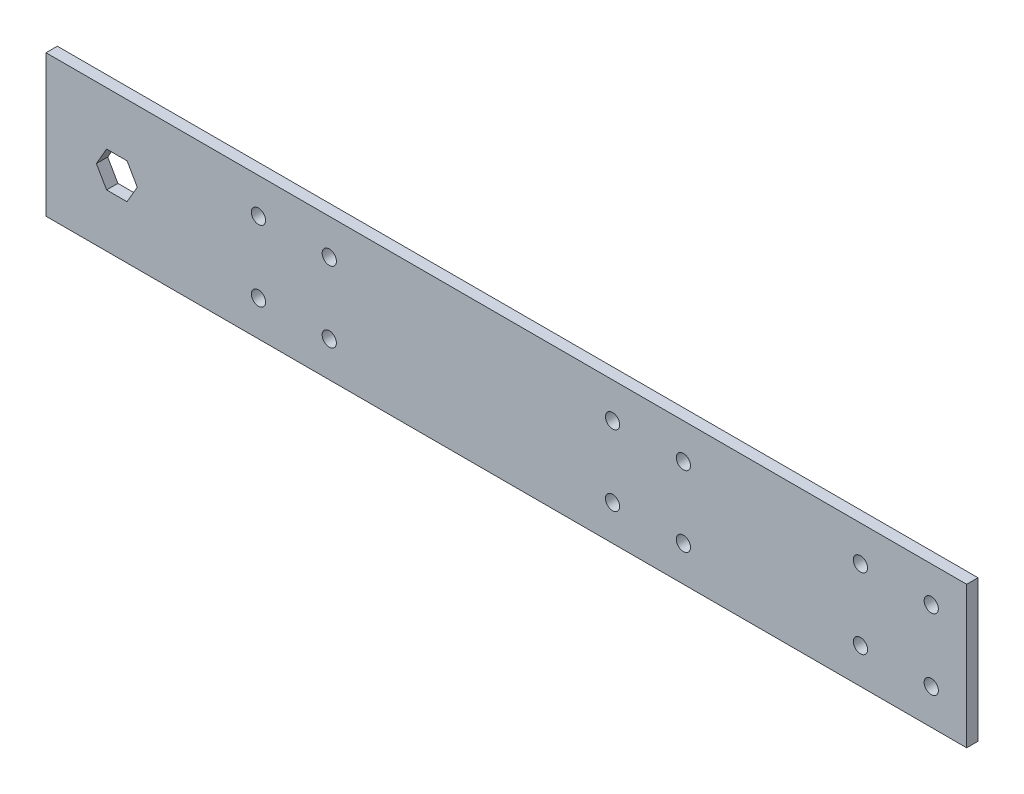
ISO-10303-21;
HEADER;
FILE_DESCRIPTION(('STEP AP214'),'2;1');
FILE_NAME('part.step','',(''),(''),'','','');
FILE_SCHEMA(('AUTOMOTIVE_DESIGN { 1 0 10303 214 1 1 1 1 }'));
ENDSEC;
DATA;
#1=APPLICATION_CONTEXT('core data for automotive mechanical design processes');
#2=APPLICATION_PROTOCOL_DEFINITION('international standard','automotive_design',2000,#1);
#3=PRODUCT_CONTEXT('',#1,'mechanical');
#4=PRODUCT('Part','Part','',(#3));
#5=PRODUCT_RELATED_PRODUCT_CATEGORY('part','',(#4));
#6=PRODUCT_DEFINITION_FORMATION('','',#4);
#7=PRODUCT_DEFINITION_CONTEXT('part definition',#1,'design');
#8=PRODUCT_DEFINITION('design','',#6,#7);
#9=PRODUCT_DEFINITION_SHAPE('','',#8);
#10=(LENGTH_UNIT() NAMED_UNIT(*) SI_UNIT(.MILLI.,.METRE.));
#11=(NAMED_UNIT(*) PLANE_ANGLE_UNIT() SI_UNIT($,.RADIAN.));
#12=(NAMED_UNIT(*) SI_UNIT($,.STERADIAN.) SOLID_ANGLE_UNIT());
#13=UNCERTAINTY_MEASURE_WITH_UNIT(LENGTH_MEASURE(1.E-05),#10,'distance_accuracy_value','');
#14=(GEOMETRIC_REPRESENTATION_CONTEXT(3) GLOBAL_UNCERTAINTY_ASSIGNED_CONTEXT((#13)) GLOBAL_UNIT_ASSIGNED_CONTEXT((#10,
#11,#12)) REPRESENTATION_CONTEXT('',''));
#15=CARTESIAN_POINT('',(0.,0.,0.));
#16=DIRECTION('',(0.,0.,1.));
#17=DIRECTION('',(1.,0.,0.));
#18=AXIS2_PLACEMENT_3D('',#15,#16,#17);
#19=CARTESIAN_POINT('',(0.,0.,4.064));
#20=DIRECTION('',(1.,0.,0.));
#21=DIRECTION('',(0.,0.,-1.));
#22=AXIS2_PLACEMENT_3D('',#19,#20,#21);
#23=PLANE('',#22);
#24=DIRECTION('',(0.,-1.,0.));
#25=VECTOR('',#24,1.);
#26=CARTESIAN_POINT('',(0.,0.,0.));
#27=LINE('',#26,#25);
#28=CARTESIAN_POINT('',(0.,50.8,0.));
#29=VERTEX_POINT('',#28);
#30=CARTESIAN_POINT('',(0.,0.,0.));
#31=VERTEX_POINT('',#30);
#32=EDGE_CURVE('E211',#29,#31,#27,.T.);
#33=ORIENTED_EDGE('',*,*,#32,.T.);
#34=DIRECTION('',(0.,0.,-1.));
#35=VECTOR('',#34,1.);
#36=CARTESIAN_POINT('',(0.,0.,4.064));
#37=LINE('',#36,#35);
#38=CARTESIAN_POINT('',(0.,0.,4.064));
#39=VERTEX_POINT('',#38);
#40=EDGE_CURVE('E11',#39,#31,#37,.T.);
#41=ORIENTED_EDGE('',*,*,#40,.F.);
#42=DIRECTION('',(0.,-1.,0.));
#43=VECTOR('',#42,1.);
#44=CARTESIAN_POINT('',(0.,0.,4.064));
#45=LINE('',#44,#43);
#46=CARTESIAN_POINT('',(0.,50.8,4.064));
#47=VERTEX_POINT('',#46);
#48=EDGE_CURVE('E212',#47,#39,#45,.T.);
#49=ORIENTED_EDGE('',*,*,#48,.F.);
#50=DIRECTION('',(0.,0.,-1.));
#51=VECTOR('',#50,1.);
#52=CARTESIAN_POINT('',(0.,50.8,4.064));
#53=LINE('',#52,#51);
#54=EDGE_CURVE('E222',#47,#29,#53,.T.);
#55=ORIENTED_EDGE('',*,*,#54,.T.);
#56=EDGE_LOOP('',(#33,#41,#49,#55));
#57=FACE_BOUND('',#56,.T.);
#58=ADVANCED_FACE('F32',(#57),#23,.F.);
#59=CARTESIAN_POINT('',(0.,0.,4.064));
#60=DIRECTION('',(0.,1.,0.));
#61=DIRECTION('',(0.,0.,1.));
#62=AXIS2_PLACEMENT_3D('',#59,#60,#61);
#63=PLANE('',#62);
#64=DIRECTION('',(1.,0.,0.));
#65=VECTOR('',#64,1.);
#66=CARTESIAN_POINT('',(0.,0.,0.));
#67=LINE('',#66,#65);
#68=CARTESIAN_POINT('',(330.2,0.,0.));
#69=VERTEX_POINT('',#68);
#70=EDGE_CURVE('E225',#31,#69,#67,.T.);
#71=ORIENTED_EDGE('',*,*,#70,.T.);
#72=DIRECTION('',(0.,0.,-1.));
#73=VECTOR('',#72,1.);
#74=CARTESIAN_POINT('',(330.2,0.,4.064));
#75=LINE('',#74,#73);
#76=CARTESIAN_POINT('',(330.2,0.,4.064));
#77=VERTEX_POINT('',#76);
#78=EDGE_CURVE('E39',#77,#69,#75,.T.);
#79=ORIENTED_EDGE('',*,*,#78,.F.);
#80=DIRECTION('',(1.,0.,0.));
#81=VECTOR('',#80,1.);
#82=CARTESIAN_POINT('',(0.,0.,4.064));
#83=LINE('',#82,#81);
#84=EDGE_CURVE('E215',#39,#77,#83,.T.);
#85=ORIENTED_EDGE('',*,*,#84,.F.);
#86=ORIENTED_EDGE('',*,*,#40,.T.);
#87=EDGE_LOOP('',(#71,#79,#85,#86));
#88=FACE_BOUND('',#87,.T.);
#89=ADVANCED_FACE('F254',(#88),#63,.F.);
#90=CARTESIAN_POINT('',(330.2,0.,4.064));
#91=DIRECTION('',(-1.,0.,0.));
#92=DIRECTION('',(0.,0.,1.));
#93=AXIS2_PLACEMENT_3D('',#90,#91,#92);
#94=PLANE('',#93);
#95=DIRECTION('',(0.,1.,0.));
#96=VECTOR('',#95,1.);
#97=CARTESIAN_POINT('',(330.2,0.,0.));
#98=LINE('',#97,#96);
#99=CARTESIAN_POINT('',(330.2,50.8,0.));
#100=VERTEX_POINT('',#99);
#101=EDGE_CURVE('E227',#69,#100,#98,.T.);
#102=ORIENTED_EDGE('',*,*,#101,.T.);
#103=DIRECTION('',(0.,0.,-1.));
#104=VECTOR('',#103,1.);
#105=CARTESIAN_POINT('',(330.2,50.8,4.064));
#106=LINE('',#105,#104);
#107=CARTESIAN_POINT('',(330.2,50.8,4.064));
#108=VERTEX_POINT('',#107);
#109=EDGE_CURVE('E232',#108,#100,#106,.T.);
#110=ORIENTED_EDGE('',*,*,#109,.F.);
#111=DIRECTION('',(0.,1.,0.));
#112=VECTOR('',#111,1.);
#113=CARTESIAN_POINT('',(330.2,0.,4.064));
#114=LINE('',#113,#112);
#115=EDGE_CURVE('E218',#77,#108,#114,.T.);
#116=ORIENTED_EDGE('',*,*,#115,.F.);
#117=ORIENTED_EDGE('',*,*,#78,.T.);
#118=EDGE_LOOP('',(#102,#110,#116,#117));
#119=FACE_BOUND('',#118,.T.);
#120=ADVANCED_FACE('F239',(#119),#94,.F.);
#121=CARTESIAN_POINT('',(0.,50.8,4.064));
#122=DIRECTION('',(0.,-1.,0.));
#123=DIRECTION('',(0.,0.,-1.));
#124=AXIS2_PLACEMENT_3D('',#121,#122,#123);
#125=PLANE('',#124);
#126=DIRECTION('',(-1.,0.,0.));
#127=VECTOR('',#126,1.);
#128=CARTESIAN_POINT('',(0.,50.8,0.));
#129=LINE('',#128,#127);
#130=EDGE_CURVE('E216',#100,#29,#129,.T.);
#131=ORIENTED_EDGE('',*,*,#130,.T.);
#132=ORIENTED_EDGE('',*,*,#54,.F.);
#133=DIRECTION('',(-1.,0.,0.));
#134=VECTOR('',#133,1.);
#135=CARTESIAN_POINT('',(0.,50.8,4.064));
#136=LINE('',#135,#134);
#137=EDGE_CURVE('E220',#108,#47,#136,.T.);
#138=ORIENTED_EDGE('',*,*,#137,.F.);
#139=ORIENTED_EDGE('',*,*,#109,.T.);
#140=EDGE_LOOP('',(#131,#132,#138,#139));
#141=FACE_BOUND('',#140,.T.);
#142=ADVANCED_FACE('F247',(#141),#125,.F.);
#143=CARTESIAN_POINT('',(0.,0.,4.064));
#144=DIRECTION('',(0.,0.,-1.));
#145=DIRECTION('',(-1.,0.,0.));
#146=AXIS2_PLACEMENT_3D('',#143,#144,#145);
#147=PLANE('',#146);
#148=CARTESIAN_POINT('',(317.5,38.1,4.064));
#149=DIRECTION('',(0.,0.,1.));
#150=DIRECTION('',(1.,0.,0.));
#151=AXIS2_PLACEMENT_3D('',#148,#149,#150);
#152=CIRCLE('',#151,2.55269999999996);
#153=CARTESIAN_POINT('',(320.0527,38.1,4.064));
#154=VERTEX_POINT('',#153);
#155=EDGE_CURVE('E344',#154,#154,#152,.T.);
#156=ORIENTED_EDGE('',*,*,#155,.F.);
#157=EDGE_LOOP('',(#156));
#158=FACE_BOUND('',#157,.T.);
#159=CARTESIAN_POINT('',(292.1,12.7,4.064));
#160=DIRECTION('',(0.,0.,1.));
#161=DIRECTION('',(1.,0.,0.));
#162=AXIS2_PLACEMENT_3D('',#159,#160,#161);
#163=CIRCLE('',#162,2.55269999999996);
#164=CARTESIAN_POINT('',(294.6527,12.7,4.064));
#165=VERTEX_POINT('',#164);
#166=EDGE_CURVE('E346',#165,#165,#163,.T.);
#167=ORIENTED_EDGE('',*,*,#166,.F.);
#168=EDGE_LOOP('',(#167));
#169=FACE_BOUND('',#168,.T.);
#170=CARTESIAN_POINT('',(317.5,12.7,4.064));
#171=DIRECTION('',(0.,0.,1.));
#172=DIRECTION('',(1.,0.,0.));
#173=AXIS2_PLACEMENT_3D('',#170,#171,#172);
#174=CIRCLE('',#173,2.55269999999996);
#175=CARTESIAN_POINT('',(320.0527,12.7,4.064));
#176=VERTEX_POINT('',#175);
#177=EDGE_CURVE('E354',#176,#176,#174,.T.);
#178=ORIENTED_EDGE('',*,*,#177,.F.);
#179=EDGE_LOOP('',(#178));
#180=FACE_BOUND('',#179,.T.);
#181=CARTESIAN_POINT('',(292.1,38.1,4.064));
#182=DIRECTION('',(0.,0.,1.));
#183=DIRECTION('',(1.,0.,0.));
#184=AXIS2_PLACEMENT_3D('',#181,#182,#183);
#185=CIRCLE('',#184,2.55269999999996);
#186=CARTESIAN_POINT('',(294.6527,38.1,4.064));
#187=VERTEX_POINT('',#186);
#188=EDGE_CURVE('E359',#187,#187,#185,.T.);
#189=ORIENTED_EDGE('',*,*,#188,.F.);
#190=EDGE_LOOP('',(#189));
#191=FACE_BOUND('',#190,.T.);
#192=DIRECTION('',(-0.499999999999999,-0.866025403784439,0.));
#193=VECTOR('',#192,1.);
#194=CARTESIAN_POINT('',(21.7338257906459,31.75,4.064));
#195=LINE('',#194,#193);
#196=CARTESIAN_POINT('',(21.7338257906459,31.75,4.064));
#197=VERTEX_POINT('',#196);
#198=CARTESIAN_POINT('',(18.0676515812917,25.4,4.064));
#199=VERTEX_POINT('',#198);
#200=EDGE_CURVE('E144',#197,#199,#195,.T.);
#201=ORIENTED_EDGE('',*,*,#200,.F.);
#202=DIRECTION('',(-1.,0.,0.));
#203=VECTOR('',#202,1.);
#204=CARTESIAN_POINT('',(29.0661742093541,31.75,4.064));
#205=LINE('',#204,#203);
#206=CARTESIAN_POINT('',(29.0661742093541,31.75,4.064));
#207=VERTEX_POINT('',#206);
#208=EDGE_CURVE('E46',#207,#197,#205,.T.);
#209=ORIENTED_EDGE('',*,*,#208,.F.);
#210=DIRECTION('',(-0.500000000000001,0.866025403784438,0.));
#211=VECTOR('',#210,1.);
#212=CARTESIAN_POINT('',(32.7323484187082,25.4,4.064));
#213=LINE('',#212,#211);
#214=CARTESIAN_POINT('',(32.7323484187082,25.4,4.064));
#215=VERTEX_POINT('',#214);
#216=EDGE_CURVE('E127',#215,#207,#213,.T.);
#217=ORIENTED_EDGE('',*,*,#216,.F.);
#218=DIRECTION('',(0.5,0.866025403784439,0.));
#219=VECTOR('',#218,1.);
#220=CARTESIAN_POINT('',(29.0661742093541,19.05,4.064));
#221=LINE('',#220,#219);
#222=CARTESIAN_POINT('',(29.0661742093541,19.05,4.064));
#223=VERTEX_POINT('',#222);
#224=EDGE_CURVE('E130',#223,#215,#221,.T.);
#225=ORIENTED_EDGE('',*,*,#224,.F.);
#226=DIRECTION('',(1.,0.,0.));
#227=VECTOR('',#226,1.);
#228=CARTESIAN_POINT('',(21.7338257906459,19.05,4.064));
#229=LINE('',#228,#227);
#230=CARTESIAN_POINT('',(21.7338257906459,19.05,4.064));
#231=VERTEX_POINT('',#230);
#232=EDGE_CURVE('E149',#231,#223,#229,.T.);
#233=ORIENTED_EDGE('',*,*,#232,.F.);
#234=DIRECTION('',(0.5,-0.866025403784438,0.));
#235=VECTOR('',#234,1.);
#236=CARTESIAN_POINT('',(18.0676515812917,25.4,4.064));
#237=LINE('',#236,#235);
#238=EDGE_CURVE('E146',#199,#231,#237,.T.);
#239=ORIENTED_EDGE('',*,*,#238,.F.);
#240=EDGE_LOOP('',(#201,#209,#217,#225,#233,#239));
#241=FACE_BOUND('',#240,.T.);
#242=CARTESIAN_POINT('',(203.2,12.7,4.064));
#243=DIRECTION('',(0.,0.,1.));
#244=DIRECTION('',(1.,0.,0.));
#245=AXIS2_PLACEMENT_3D('',#242,#243,#244);
#246=CIRCLE('',#245,2.55269999999999);
#247=CARTESIAN_POINT('',(205.7527,12.7,4.064));
#248=VERTEX_POINT('',#247);
#249=EDGE_CURVE('E156',#248,#248,#246,.T.);
#250=ORIENTED_EDGE('',*,*,#249,.F.);
#251=EDGE_LOOP('',(#250));
#252=FACE_BOUND('',#251,.T.);
#253=CARTESIAN_POINT('',(228.6,38.1,4.064));
#254=DIRECTION('',(0.,0.,1.));
#255=DIRECTION('',(1.,0.,0.));
#256=AXIS2_PLACEMENT_3D('',#253,#254,#255);
#257=CIRCLE('',#256,2.55269999999999);
#258=CARTESIAN_POINT('',(231.1527,38.1,4.064));
#259=VERTEX_POINT('',#258);
#260=EDGE_CURVE('E169',#259,#259,#257,.T.);
#261=ORIENTED_EDGE('',*,*,#260,.F.);
#262=EDGE_LOOP('',(#261));
#263=FACE_BOUND('',#262,.T.);
#264=CARTESIAN_POINT('',(203.2,38.1,4.064));
#265=DIRECTION('',(0.,0.,1.));
#266=DIRECTION('',(1.,0.,0.));
#267=AXIS2_PLACEMENT_3D('',#264,#265,#266);
#268=CIRCLE('',#267,2.55269999999999);
#269=CARTESIAN_POINT('',(205.7527,38.1,4.064));
#270=VERTEX_POINT('',#269);
#271=EDGE_CURVE('E175',#270,#270,#268,.T.);
#272=ORIENTED_EDGE('',*,*,#271,.F.);
#273=EDGE_LOOP('',(#272));
#274=FACE_BOUND('',#273,.T.);
#275=CARTESIAN_POINT('',(228.6,12.7,4.064));
#276=DIRECTION('',(0.,0.,1.));
#277=DIRECTION('',(1.,0.,0.));
#278=AXIS2_PLACEMENT_3D('',#275,#276,#277);
#279=CIRCLE('',#278,2.55269999999999);
#280=CARTESIAN_POINT('',(231.1527,12.7,4.064));
#281=VERTEX_POINT('',#280);
#282=EDGE_CURVE('E181',#281,#281,#279,.T.);
#283=ORIENTED_EDGE('',*,*,#282,.F.);
#284=EDGE_LOOP('',(#283));
#285=FACE_BOUND('',#284,.T.);
#286=CARTESIAN_POINT('',(76.2,38.1,4.064));
#287=DIRECTION('',(0.,0.,1.));
#288=DIRECTION('',(1.,0.,0.));
#289=AXIS2_PLACEMENT_3D('',#286,#287,#288);
#290=CIRCLE('',#289,2.55269999999999);
#291=CARTESIAN_POINT('',(78.7527,38.1,4.064));
#292=VERTEX_POINT('',#291);
#293=EDGE_CURVE('E187',#292,#292,#290,.T.);
#294=ORIENTED_EDGE('',*,*,#293,.F.);
#295=EDGE_LOOP('',(#294));
#296=FACE_BOUND('',#295,.T.);
#297=CARTESIAN_POINT('',(101.6,12.7,4.064));
#298=DIRECTION('',(0.,0.,1.));
#299=DIRECTION('',(1.,0.,0.));
#300=AXIS2_PLACEMENT_3D('',#297,#298,#299);
#301=CIRCLE('',#300,2.55269999999999);
#302=CARTESIAN_POINT('',(104.1527,12.7,4.064));
#303=VERTEX_POINT('',#302);
#304=EDGE_CURVE('E193',#303,#303,#301,.T.);
#305=ORIENTED_EDGE('',*,*,#304,.F.);
#306=EDGE_LOOP('',(#305));
#307=FACE_BOUND('',#306,.T.);
#308=CARTESIAN_POINT('',(76.2,12.7,4.064));
#309=DIRECTION('',(0.,0.,1.));
#310=DIRECTION('',(1.,0.,0.));
#311=AXIS2_PLACEMENT_3D('',#308,#309,#310);
#312=CIRCLE('',#311,2.55269999999999);
#313=CARTESIAN_POINT('',(78.7527,12.7,4.064));
#314=VERTEX_POINT('',#313);
#315=EDGE_CURVE('E199',#314,#314,#312,.T.);
#316=ORIENTED_EDGE('',*,*,#315,.F.);
#317=EDGE_LOOP('',(#316));
#318=FACE_BOUND('',#317,.T.);
#319=CARTESIAN_POINT('',(101.6,38.1,4.064));
#320=DIRECTION('',(0.,0.,1.));
#321=DIRECTION('',(1.,0.,0.));
#322=AXIS2_PLACEMENT_3D('',#319,#320,#321);
#323=CIRCLE('',#322,2.55269999999999);
#324=CARTESIAN_POINT('',(104.1527,38.1,4.064));
#325=VERTEX_POINT('',#324);
#326=EDGE_CURVE('E205',#325,#325,#323,.T.);
#327=ORIENTED_EDGE('',*,*,#326,.F.);
#328=EDGE_LOOP('',(#327));
#329=FACE_BOUND('',#328,.T.);
#330=ORIENTED_EDGE('',*,*,#48,.T.);
#331=ORIENTED_EDGE('',*,*,#84,.T.);
#332=ORIENTED_EDGE('',*,*,#115,.T.);
#333=ORIENTED_EDGE('',*,*,#137,.T.);
#334=EDGE_LOOP('',(#330,#331,#332,#333));
#335=FACE_BOUND('',#334,.T.);
#336=ADVANCED_FACE('F253',(#158,#169,#180,#191,#241,#252,#263,#274,#285,#296,#307,#318,#329,
#335),#147,.F.);
#337=CARTESIAN_POINT('',(0.,0.,0.));
#338=DIRECTION('',(0.,0.,-1.));
#339=DIRECTION('',(-1.,0.,0.));
#340=AXIS2_PLACEMENT_3D('',#337,#338,#339);
#341=PLANE('',#340);
#342=CARTESIAN_POINT('',(317.5,38.1,0.));
#343=DIRECTION('',(0.,0.,1.));
#344=DIRECTION('',(1.,0.,0.));
#345=AXIS2_PLACEMENT_3D('',#342,#343,#344);
#346=CIRCLE('',#345,2.55270000000002);
#347=CARTESIAN_POINT('',(320.0527,38.1,0.));
#348=VERTEX_POINT('',#347);
#349=EDGE_CURVE('E341',#348,#348,#346,.T.);
#350=ORIENTED_EDGE('',*,*,#349,.T.);
#351=EDGE_LOOP('',(#350));
#352=FACE_BOUND('',#351,.T.);
#353=CARTESIAN_POINT('',(292.1,12.7,0.));
#354=DIRECTION('',(0.,0.,1.));
#355=DIRECTION('',(1.,0.,0.));
#356=AXIS2_PLACEMENT_3D('',#353,#354,#355);
#357=CIRCLE('',#356,2.55270000000002);
#358=CARTESIAN_POINT('',(294.6527,12.7,0.));
#359=VERTEX_POINT('',#358);
#360=EDGE_CURVE('E351',#359,#359,#357,.T.);
#361=ORIENTED_EDGE('',*,*,#360,.T.);
#362=EDGE_LOOP('',(#361));
#363=FACE_BOUND('',#362,.T.);
#364=CARTESIAN_POINT('',(317.5,12.7,0.));
#365=DIRECTION('',(0.,0.,1.));
#366=DIRECTION('',(1.,0.,0.));
#367=AXIS2_PLACEMENT_3D('',#364,#365,#366);
#368=CIRCLE('',#367,2.55270000000002);
#369=CARTESIAN_POINT('',(320.0527,12.7,0.));
#370=VERTEX_POINT('',#369);
#371=EDGE_CURVE('E357',#370,#370,#368,.T.);
#372=ORIENTED_EDGE('',*,*,#371,.T.);
#373=EDGE_LOOP('',(#372));
#374=FACE_BOUND('',#373,.T.);
#375=CARTESIAN_POINT('',(292.1,38.1,0.));
#376=DIRECTION('',(0.,0.,1.));
#377=DIRECTION('',(1.,0.,0.));
#378=AXIS2_PLACEMENT_3D('',#375,#376,#377);
#379=CIRCLE('',#378,2.55270000000002);
#380=CARTESIAN_POINT('',(294.6527,38.1,0.));
#381=VERTEX_POINT('',#380);
#382=EDGE_CURVE('E133',#381,#381,#379,.T.);
#383=ORIENTED_EDGE('',*,*,#382,.T.);
#384=EDGE_LOOP('',(#383));
#385=FACE_BOUND('',#384,.T.);
#386=DIRECTION('',(-1.,0.,0.));
#387=VECTOR('',#386,1.);
#388=CARTESIAN_POINT('',(29.0661742093541,31.75,0.));
#389=LINE('',#388,#387);
#390=CARTESIAN_POINT('',(29.0661742093541,31.75,0.));
#391=VERTEX_POINT('',#390);
#392=CARTESIAN_POINT('',(21.7338257906459,31.75,0.));
#393=VERTEX_POINT('',#392);
#394=EDGE_CURVE('E110',#391,#393,#389,.T.);
#395=ORIENTED_EDGE('',*,*,#394,.T.);
#396=DIRECTION('',(-0.499999999999999,-0.866025403784439,0.));
#397=VECTOR('',#396,1.);
#398=CARTESIAN_POINT('',(21.7338257906459,31.75,0.));
#399=LINE('',#398,#397);
#400=CARTESIAN_POINT('',(18.0676515812918,25.4,0.));
#401=VERTEX_POINT('',#400);
#402=EDGE_CURVE('E119',#393,#401,#399,.T.);
#403=ORIENTED_EDGE('',*,*,#402,.T.);
#404=DIRECTION('',(0.5,-0.866025403784438,0.));
#405=VECTOR('',#404,1.);
#406=CARTESIAN_POINT('',(18.0676515812917,25.4,0.));
#407=LINE('',#406,#405);
#408=CARTESIAN_POINT('',(21.7338257906459,19.05,0.));
#409=VERTEX_POINT('',#408);
#410=EDGE_CURVE('E54',#401,#409,#407,.T.);
#411=ORIENTED_EDGE('',*,*,#410,.T.);
#412=DIRECTION('',(1.,0.,0.));
#413=VECTOR('',#412,1.);
#414=CARTESIAN_POINT('',(21.7338257906459,19.05,0.));
#415=LINE('',#414,#413);
#416=CARTESIAN_POINT('',(29.0661742093541,19.05,0.));
#417=VERTEX_POINT('',#416);
#418=EDGE_CURVE('E137',#409,#417,#415,.T.);
#419=ORIENTED_EDGE('',*,*,#418,.T.);
#420=DIRECTION('',(0.5,0.866025403784439,0.));
#421=VECTOR('',#420,1.);
#422=CARTESIAN_POINT('',(29.0661742093541,19.05,0.));
#423=LINE('',#422,#421);
#424=CARTESIAN_POINT('',(32.7323484187082,25.4,0.));
#425=VERTEX_POINT('',#424);
#426=EDGE_CURVE('E140',#417,#425,#423,.T.);
#427=ORIENTED_EDGE('',*,*,#426,.T.);
#428=DIRECTION('',(-0.500000000000001,0.866025403784438,0.));
#429=VECTOR('',#428,1.);
#430=CARTESIAN_POINT('',(32.7323484187082,25.4,0.));
#431=LINE('',#430,#429);
#432=EDGE_CURVE('E116',#425,#391,#431,.T.);
#433=ORIENTED_EDGE('',*,*,#432,.T.);
#434=EDGE_LOOP('',(#395,#403,#411,#419,#427,#433));
#435=FACE_BOUND('',#434,.T.);
#436=CARTESIAN_POINT('',(203.2,12.7,0.));
#437=DIRECTION('',(0.,0.,1.));
#438=DIRECTION('',(1.,0.,0.));
#439=AXIS2_PLACEMENT_3D('',#436,#437,#438);
#440=CIRCLE('',#439,2.55269999999999);
#441=CARTESIAN_POINT('',(205.7527,12.7,0.));
#442=VERTEX_POINT('',#441);
#443=EDGE_CURVE('E166',#442,#442,#440,.T.);
#444=ORIENTED_EDGE('',*,*,#443,.T.);
#445=EDGE_LOOP('',(#444));
#446=FACE_BOUND('',#445,.T.);
#447=CARTESIAN_POINT('',(228.6,38.1,0.));
#448=DIRECTION('',(0.,0.,1.));
#449=DIRECTION('',(1.,0.,0.));
#450=AXIS2_PLACEMENT_3D('',#447,#448,#449);
#451=CIRCLE('',#450,2.55269999999999);
#452=CARTESIAN_POINT('',(231.1527,38.1,0.));
#453=VERTEX_POINT('',#452);
#454=EDGE_CURVE('E172',#453,#453,#451,.T.);
#455=ORIENTED_EDGE('',*,*,#454,.T.);
#456=EDGE_LOOP('',(#455));
#457=FACE_BOUND('',#456,.T.);
#458=CARTESIAN_POINT('',(203.2,38.1,0.));
#459=DIRECTION('',(0.,0.,1.));
#460=DIRECTION('',(1.,0.,0.));
#461=AXIS2_PLACEMENT_3D('',#458,#459,#460);
#462=CIRCLE('',#461,2.55269999999999);
#463=CARTESIAN_POINT('',(205.7527,38.1,0.));
#464=VERTEX_POINT('',#463);
#465=EDGE_CURVE('E178',#464,#464,#462,.T.);
#466=ORIENTED_EDGE('',*,*,#465,.T.);
#467=EDGE_LOOP('',(#466));
#468=FACE_BOUND('',#467,.T.);
#469=CARTESIAN_POINT('',(228.6,12.7,0.));
#470=DIRECTION('',(0.,0.,1.));
#471=DIRECTION('',(1.,0.,0.));
#472=AXIS2_PLACEMENT_3D('',#469,#470,#471);
#473=CIRCLE('',#472,2.55269999999999);
#474=CARTESIAN_POINT('',(231.1527,12.7,0.));
#475=VERTEX_POINT('',#474);
#476=EDGE_CURVE('E184',#475,#475,#473,.T.);
#477=ORIENTED_EDGE('',*,*,#476,.T.);
#478=EDGE_LOOP('',(#477));
#479=FACE_BOUND('',#478,.T.);
#480=CARTESIAN_POINT('',(76.2,38.1,0.));
#481=DIRECTION('',(0.,0.,1.));
#482=DIRECTION('',(1.,0.,0.));
#483=AXIS2_PLACEMENT_3D('',#480,#481,#482);
#484=CIRCLE('',#483,2.55269999999999);
#485=CARTESIAN_POINT('',(78.7527,38.1,0.));
#486=VERTEX_POINT('',#485);
#487=EDGE_CURVE('E190',#486,#486,#484,.T.);
#488=ORIENTED_EDGE('',*,*,#487,.T.);
#489=EDGE_LOOP('',(#488));
#490=FACE_BOUND('',#489,.T.);
#491=CARTESIAN_POINT('',(101.6,12.7,0.));
#492=DIRECTION('',(0.,0.,1.));
#493=DIRECTION('',(1.,0.,0.));
#494=AXIS2_PLACEMENT_3D('',#491,#492,#493);
#495=CIRCLE('',#494,2.55269999999999);
#496=CARTESIAN_POINT('',(104.1527,12.7,0.));
#497=VERTEX_POINT('',#496);
#498=EDGE_CURVE('E196',#497,#497,#495,.T.);
#499=ORIENTED_EDGE('',*,*,#498,.T.);
#500=EDGE_LOOP('',(#499));
#501=FACE_BOUND('',#500,.T.);
#502=CARTESIAN_POINT('',(76.2,12.7,0.));
#503=DIRECTION('',(0.,0.,1.));
#504=DIRECTION('',(1.,0.,0.));
#505=AXIS2_PLACEMENT_3D('',#502,#503,#504);
#506=CIRCLE('',#505,2.55269999999999);
#507=CARTESIAN_POINT('',(78.7527,12.7,0.));
#508=VERTEX_POINT('',#507);
#509=EDGE_CURVE('E202',#508,#508,#506,.T.);
#510=ORIENTED_EDGE('',*,*,#509,.T.);
#511=EDGE_LOOP('',(#510));
#512=FACE_BOUND('',#511,.T.);
#513=CARTESIAN_POINT('',(101.6,38.1,0.));
#514=DIRECTION('',(0.,0.,1.));
#515=DIRECTION('',(1.,0.,0.));
#516=AXIS2_PLACEMENT_3D('',#513,#514,#515);
#517=CIRCLE('',#516,2.55269999999999);
#518=CARTESIAN_POINT('',(104.1527,38.1,0.));
#519=VERTEX_POINT('',#518);
#520=EDGE_CURVE('E208',#519,#519,#517,.T.);
#521=ORIENTED_EDGE('',*,*,#520,.T.);
#522=EDGE_LOOP('',(#521));
#523=FACE_BOUND('',#522,.T.);
#524=ORIENTED_EDGE('',*,*,#32,.F.);
#525=ORIENTED_EDGE('',*,*,#130,.F.);
#526=ORIENTED_EDGE('',*,*,#101,.F.);
#527=ORIENTED_EDGE('',*,*,#70,.F.);
#528=EDGE_LOOP('',(#524,#525,#526,#527));
#529=FACE_BOUND('',#528,.T.);
#530=ADVANCED_FACE('F123',(#352,#363,#374,#385,#435,#446,#457,#468,#479,#490,#501,#512,#523,
#529),#341,.T.);
#531=CARTESIAN_POINT('',(101.6,38.1,4.064));
#532=DIRECTION('',(0.,0.,1.));
#533=DIRECTION('',(1.,0.,0.));
#534=AXIS2_PLACEMENT_3D('',#531,#532,#533);
#535=CYLINDRICAL_SURFACE('',#534,2.55269999999999);
#536=ORIENTED_EDGE('',*,*,#520,.F.);
#537=EDGE_LOOP('',(#536));
#538=FACE_BOUND('',#537,.T.);
#539=ORIENTED_EDGE('',*,*,#326,.T.);
#540=EDGE_LOOP('',(#539));
#541=FACE_BOUND('',#540,.T.);
#542=ADVANCED_FACE('F266',(#538,#541),#535,.F.);
#543=CARTESIAN_POINT('',(76.2,12.7,4.064));
#544=DIRECTION('',(0.,0.,1.));
#545=DIRECTION('',(1.,0.,0.));
#546=AXIS2_PLACEMENT_3D('',#543,#544,#545);
#547=CYLINDRICAL_SURFACE('',#546,2.55269999999999);
#548=ORIENTED_EDGE('',*,*,#509,.F.);
#549=EDGE_LOOP('',(#548));
#550=FACE_BOUND('',#549,.T.);
#551=ORIENTED_EDGE('',*,*,#315,.T.);
#552=EDGE_LOOP('',(#551));
#553=FACE_BOUND('',#552,.T.);
#554=ADVANCED_FACE('F273',(#550,#553),#547,.F.);
#555=CARTESIAN_POINT('',(101.6,12.7,4.064));
#556=DIRECTION('',(0.,0.,1.));
#557=DIRECTION('',(1.,0.,0.));
#558=AXIS2_PLACEMENT_3D('',#555,#556,#557);
#559=CYLINDRICAL_SURFACE('',#558,2.55269999999999);
#560=ORIENTED_EDGE('',*,*,#498,.F.);
#561=EDGE_LOOP('',(#560));
#562=FACE_BOUND('',#561,.T.);
#563=ORIENTED_EDGE('',*,*,#304,.T.);
#564=EDGE_LOOP('',(#563));
#565=FACE_BOUND('',#564,.T.);
#566=ADVANCED_FACE('F277',(#562,#565),#559,.F.);
#567=CARTESIAN_POINT('',(76.2,38.1,4.064));
#568=DIRECTION('',(0.,0.,1.));
#569=DIRECTION('',(1.,0.,0.));
#570=AXIS2_PLACEMENT_3D('',#567,#568,#569);
#571=CYLINDRICAL_SURFACE('',#570,2.55269999999999);
#572=ORIENTED_EDGE('',*,*,#487,.F.);
#573=EDGE_LOOP('',(#572));
#574=FACE_BOUND('',#573,.T.);
#575=ORIENTED_EDGE('',*,*,#293,.T.);
#576=EDGE_LOOP('',(#575));
#577=FACE_BOUND('',#576,.T.);
#578=ADVANCED_FACE('F281',(#574,#577),#571,.F.);
#579=CARTESIAN_POINT('',(228.6,12.7,4.064));
#580=DIRECTION('',(0.,0.,1.));
#581=DIRECTION('',(1.,0.,0.));
#582=AXIS2_PLACEMENT_3D('',#579,#580,#581);
#583=CYLINDRICAL_SURFACE('',#582,2.55269999999999);
#584=ORIENTED_EDGE('',*,*,#476,.F.);
#585=EDGE_LOOP('',(#584));
#586=FACE_BOUND('',#585,.T.);
#587=ORIENTED_EDGE('',*,*,#282,.T.);
#588=EDGE_LOOP('',(#587));
#589=FACE_BOUND('',#588,.T.);
#590=ADVANCED_FACE('F285',(#586,#589),#583,.F.);
#591=CARTESIAN_POINT('',(203.2,38.1,4.064));
#592=DIRECTION('',(0.,0.,1.));
#593=DIRECTION('',(1.,0.,0.));
#594=AXIS2_PLACEMENT_3D('',#591,#592,#593);
#595=CYLINDRICAL_SURFACE('',#594,2.55269999999999);
#596=ORIENTED_EDGE('',*,*,#465,.F.);
#597=EDGE_LOOP('',(#596));
#598=FACE_BOUND('',#597,.T.);
#599=ORIENTED_EDGE('',*,*,#271,.T.);
#600=EDGE_LOOP('',(#599));
#601=FACE_BOUND('',#600,.T.);
#602=ADVANCED_FACE('F289',(#598,#601),#595,.F.);
#603=CARTESIAN_POINT('',(228.6,38.1,4.064));
#604=DIRECTION('',(0.,0.,1.));
#605=DIRECTION('',(1.,0.,0.));
#606=AXIS2_PLACEMENT_3D('',#603,#604,#605);
#607=CYLINDRICAL_SURFACE('',#606,2.55269999999999);
#608=ORIENTED_EDGE('',*,*,#454,.F.);
#609=EDGE_LOOP('',(#608));
#610=FACE_BOUND('',#609,.T.);
#611=ORIENTED_EDGE('',*,*,#260,.T.);
#612=EDGE_LOOP('',(#611));
#613=FACE_BOUND('',#612,.T.);
#614=ADVANCED_FACE('F293',(#610,#613),#607,.F.);
#615=CARTESIAN_POINT('',(203.2,12.7,4.064));
#616=DIRECTION('',(0.,0.,1.));
#617=DIRECTION('',(1.,0.,0.));
#618=AXIS2_PLACEMENT_3D('',#615,#616,#617);
#619=CYLINDRICAL_SURFACE('',#618,2.55269999999999);
#620=ORIENTED_EDGE('',*,*,#443,.F.);
#621=EDGE_LOOP('',(#620));
#622=FACE_BOUND('',#621,.T.);
#623=ORIENTED_EDGE('',*,*,#249,.T.);
#624=EDGE_LOOP('',(#623));
#625=FACE_BOUND('',#624,.T.);
#626=ADVANCED_FACE('F297',(#622,#625),#619,.F.);
#627=CARTESIAN_POINT('',(29.0661742093541,31.75,0.));
#628=DIRECTION('',(0.,1.,0.));
#629=DIRECTION('',(0.,0.,1.));
#630=AXIS2_PLACEMENT_3D('',#627,#628,#629);
#631=PLANE('',#630);
#632=ORIENTED_EDGE('',*,*,#208,.T.);
#633=DIRECTION('',(0.,0.,1.));
#634=VECTOR('',#633,1.);
#635=CARTESIAN_POINT('',(21.7338257906459,31.75,0.));
#636=LINE('',#635,#634);
#637=EDGE_CURVE('E106',#393,#197,#636,.T.);
#638=ORIENTED_EDGE('',*,*,#637,.F.);
#639=ORIENTED_EDGE('',*,*,#394,.F.);
#640=DIRECTION('',(0.,0.,1.));
#641=VECTOR('',#640,1.);
#642=CARTESIAN_POINT('',(29.0661742093541,31.75,0.));
#643=LINE('',#642,#641);
#644=EDGE_CURVE('E154',#391,#207,#643,.T.);
#645=ORIENTED_EDGE('',*,*,#644,.T.);
#646=EDGE_LOOP('',(#632,#638,#639,#645));
#647=FACE_BOUND('',#646,.T.);
#648=ADVANCED_FACE('F108',(#647),#631,.F.);
#649=CARTESIAN_POINT('',(32.7323484187082,25.4,0.));
#650=DIRECTION('',(0.866025403784438,0.500000000000001,0.));
#651=DIRECTION('',(-0.500000000000001,0.866025403784438,0.));
#652=AXIS2_PLACEMENT_3D('',#649,#650,#651);
#653=PLANE('',#652);
#654=ORIENTED_EDGE('',*,*,#216,.T.);
#655=ORIENTED_EDGE('',*,*,#644,.F.);
#656=ORIENTED_EDGE('',*,*,#432,.F.);
#657=DIRECTION('',(0.,0.,1.));
#658=VECTOR('',#657,1.);
#659=CARTESIAN_POINT('',(32.7323484187082,25.4,0.));
#660=LINE('',#659,#658);
#661=EDGE_CURVE('E157',#425,#215,#660,.T.);
#662=ORIENTED_EDGE('',*,*,#661,.T.);
#663=EDGE_LOOP('',(#654,#655,#656,#662));
#664=FACE_BOUND('',#663,.T.);
#665=ADVANCED_FACE('F304',(#664),#653,.F.);
#666=CARTESIAN_POINT('',(29.0661742093541,19.05,0.));
#667=DIRECTION('',(0.866025403784439,-0.5,0.));
#668=DIRECTION('',(0.5,0.866025403784439,0.));
#669=AXIS2_PLACEMENT_3D('',#666,#667,#668);
#670=PLANE('',#669);
#671=ORIENTED_EDGE('',*,*,#224,.T.);
#672=ORIENTED_EDGE('',*,*,#661,.F.);
#673=ORIENTED_EDGE('',*,*,#426,.F.);
#674=DIRECTION('',(0.,0.,1.));
#675=VECTOR('',#674,1.);
#676=CARTESIAN_POINT('',(29.0661742093541,19.05,0.));
#677=LINE('',#676,#675);
#678=EDGE_CURVE('E159',#417,#223,#677,.T.);
#679=ORIENTED_EDGE('',*,*,#678,.T.);
#680=EDGE_LOOP('',(#671,#672,#673,#679));
#681=FACE_BOUND('',#680,.T.);
#682=ADVANCED_FACE('F314',(#681),#670,.F.);
#683=CARTESIAN_POINT('',(21.7338257906459,19.05,0.));
#684=DIRECTION('',(0.,-1.,0.));
#685=DIRECTION('',(0.,0.,-1.));
#686=AXIS2_PLACEMENT_3D('',#683,#684,#685);
#687=PLANE('',#686);
#688=ORIENTED_EDGE('',*,*,#232,.T.);
#689=ORIENTED_EDGE('',*,*,#678,.F.);
#690=ORIENTED_EDGE('',*,*,#418,.F.);
#691=DIRECTION('',(0.,0.,1.));
#692=VECTOR('',#691,1.);
#693=CARTESIAN_POINT('',(21.7338257906459,19.05,0.));
#694=LINE('',#693,#692);
#695=EDGE_CURVE('E161',#409,#231,#694,.T.);
#696=ORIENTED_EDGE('',*,*,#695,.T.);
#697=EDGE_LOOP('',(#688,#689,#690,#696));
#698=FACE_BOUND('',#697,.T.);
#699=ADVANCED_FACE('F311',(#698),#687,.F.);
#700=CARTESIAN_POINT('',(18.0676515812917,25.4,0.));
#701=DIRECTION('',(-0.866025403784438,-0.5,0.));
#702=DIRECTION('',(0.5,-0.866025403784439,0.));
#703=AXIS2_PLACEMENT_3D('',#700,#701,#702);
#704=PLANE('',#703);
#705=ORIENTED_EDGE('',*,*,#238,.T.);
#706=ORIENTED_EDGE('',*,*,#695,.F.);
#707=ORIENTED_EDGE('',*,*,#410,.F.);
#708=DIRECTION('',(0.,0.,1.));
#709=VECTOR('',#708,1.);
#710=CARTESIAN_POINT('',(18.0676515812917,25.4,0.));
#711=LINE('',#710,#709);
#712=EDGE_CURVE('E115',#401,#199,#711,.T.);
#713=ORIENTED_EDGE('',*,*,#712,.T.);
#714=EDGE_LOOP('',(#705,#706,#707,#713));
#715=FACE_BOUND('',#714,.T.);
#716=ADVANCED_FACE('F308',(#715),#704,.F.);
#717=CARTESIAN_POINT('',(21.7338257906459,31.75,0.));
#718=DIRECTION('',(-0.866025403784439,0.499999999999999,0.));
#719=DIRECTION('',(-0.499999999999999,-0.866025403784439,0.));
#720=AXIS2_PLACEMENT_3D('',#717,#718,#719);
#721=PLANE('',#720);
#722=ORIENTED_EDGE('',*,*,#200,.T.);
#723=ORIENTED_EDGE('',*,*,#712,.F.);
#724=ORIENTED_EDGE('',*,*,#402,.F.);
#725=ORIENTED_EDGE('',*,*,#637,.T.);
#726=EDGE_LOOP('',(#722,#723,#724,#725));
#727=FACE_BOUND('',#726,.T.);
#728=ADVANCED_FACE('F120',(#727),#721,.F.);
#729=CARTESIAN_POINT('',(292.1,38.1,4.064));
#730=DIRECTION('',(0.,0.,1.));
#731=DIRECTION('',(1.,0.,0.));
#732=AXIS2_PLACEMENT_3D('',#729,#730,#731);
#733=CYLINDRICAL_SURFACE('',#732,2.55269999999999);
#734=ORIENTED_EDGE('',*,*,#382,.F.);
#735=EDGE_LOOP('',(#734));
#736=FACE_BOUND('',#735,.T.);
#737=ORIENTED_EDGE('',*,*,#188,.T.);
#738=EDGE_LOOP('',(#737));
#739=FACE_BOUND('',#738,.T.);
#740=ADVANCED_FACE('F307',(#736,#739),#733,.F.);
#741=CARTESIAN_POINT('',(317.5,12.7,4.064));
#742=DIRECTION('',(0.,0.,1.));
#743=DIRECTION('',(1.,0.,0.));
#744=AXIS2_PLACEMENT_3D('',#741,#742,#743);
#745=CYLINDRICAL_SURFACE('',#744,2.55269999999999);
#746=ORIENTED_EDGE('',*,*,#371,.F.);
#747=EDGE_LOOP('',(#746));
#748=FACE_BOUND('',#747,.T.);
#749=ORIENTED_EDGE('',*,*,#177,.T.);
#750=EDGE_LOOP('',(#749));
#751=FACE_BOUND('',#750,.T.);
#752=ADVANCED_FACE('F324',(#748,#751),#745,.F.);
#753=CARTESIAN_POINT('',(292.1,12.7,4.064));
#754=DIRECTION('',(0.,0.,1.));
#755=DIRECTION('',(1.,0.,0.));
#756=AXIS2_PLACEMENT_3D('',#753,#754,#755);
#757=CYLINDRICAL_SURFACE('',#756,2.55269999999999);
#758=ORIENTED_EDGE('',*,*,#360,.F.);
#759=EDGE_LOOP('',(#758));
#760=FACE_BOUND('',#759,.T.);
#761=ORIENTED_EDGE('',*,*,#166,.T.);
#762=EDGE_LOOP('',(#761));
#763=FACE_BOUND('',#762,.T.);
#764=ADVANCED_FACE('F328',(#760,#763),#757,.F.);
#765=CARTESIAN_POINT('',(317.5,38.1,4.064));
#766=DIRECTION('',(0.,0.,1.));
#767=DIRECTION('',(1.,0.,0.));
#768=AXIS2_PLACEMENT_3D('',#765,#766,#767);
#769=CYLINDRICAL_SURFACE('',#768,2.55269999999999);
#770=ORIENTED_EDGE('',*,*,#349,.F.);
#771=EDGE_LOOP('',(#770));
#772=FACE_BOUND('',#771,.T.);
#773=ORIENTED_EDGE('',*,*,#155,.T.);
#774=EDGE_LOOP('',(#773));
#775=FACE_BOUND('',#774,.T.);
#776=ADVANCED_FACE('F332',(#772,#775),#769,.F.);
#777=CLOSED_SHELL('',(#58,#89,#120,#142,#336,#530,#542,#554,#566,#578,#590,#602,#614,#626,#648,
#665,#682,#699,#716,#728,#740,#752,#764,#776));
#778=MANIFOLD_SOLID_BREP('B2',#777);
#779=ADVANCED_BREP_SHAPE_REPRESENTATION('',(#18,#778),#14);
#780=SHAPE_DEFINITION_REPRESENTATION(#9,#779);
ENDSEC;
END-ISO-10303-21;
